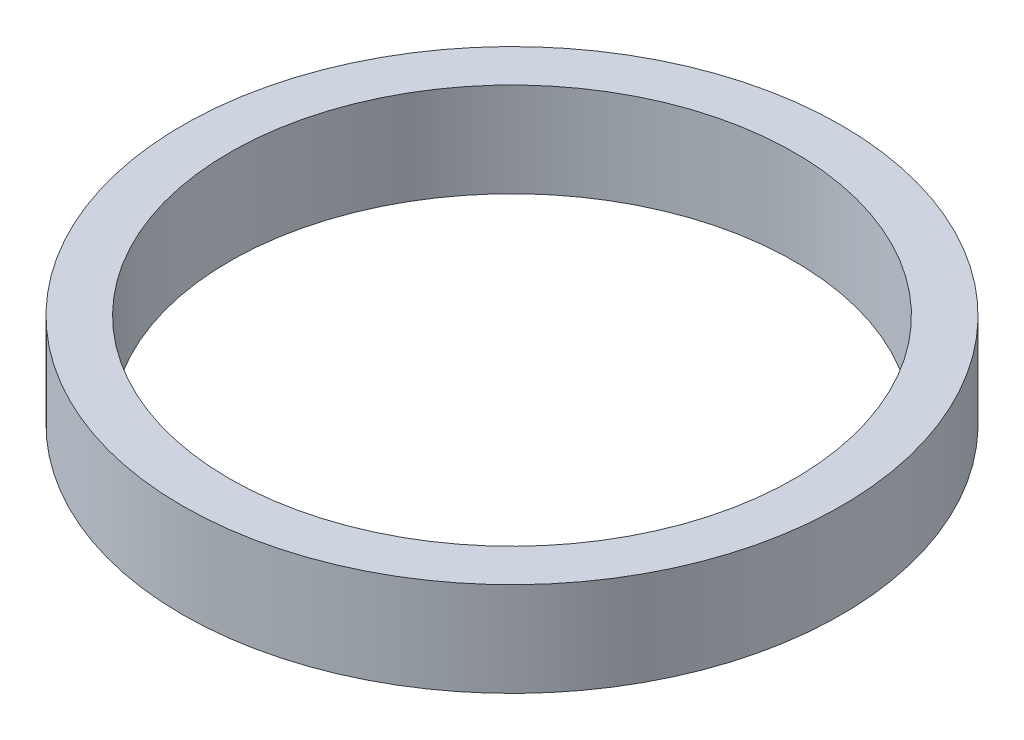
ISO-10303-21;
HEADER;
FILE_DESCRIPTION(('STEP AP214'),'2;1');
FILE_NAME('part.step','',(''),(''),'','','');
FILE_SCHEMA(('AUTOMOTIVE_DESIGN { 1 0 10303 214 1 1 1 1 }'));
ENDSEC;
DATA;
#1=APPLICATION_CONTEXT('core data for automotive mechanical design processes');
#2=APPLICATION_PROTOCOL_DEFINITION('international standard','automotive_design',2000,#1);
#3=PRODUCT_CONTEXT('',#1,'mechanical');
#4=PRODUCT('Part','Part','',(#3));
#5=PRODUCT_RELATED_PRODUCT_CATEGORY('part','',(#4));
#6=PRODUCT_DEFINITION_FORMATION('','',#4);
#7=PRODUCT_DEFINITION_CONTEXT('part definition',#1,'design');
#8=PRODUCT_DEFINITION('design','',#6,#7);
#9=PRODUCT_DEFINITION_SHAPE('','',#8);
#10=(LENGTH_UNIT() NAMED_UNIT(*) SI_UNIT(.MILLI.,.METRE.));
#11=(NAMED_UNIT(*) PLANE_ANGLE_UNIT() SI_UNIT($,.RADIAN.));
#12=(NAMED_UNIT(*) SI_UNIT($,.STERADIAN.) SOLID_ANGLE_UNIT());
#13=UNCERTAINTY_MEASURE_WITH_UNIT(LENGTH_MEASURE(1.E-05),#10,'distance_accuracy_value','');
#14=(GEOMETRIC_REPRESENTATION_CONTEXT(3) GLOBAL_UNCERTAINTY_ASSIGNED_CONTEXT((#13)) GLOBAL_UNIT_ASSIGNED_CONTEXT((#10,
#11,#12)) REPRESENTATION_CONTEXT('',''));
#15=CARTESIAN_POINT('',(0.,0.,0.));
#16=DIRECTION('',(0.,0.,1.));
#17=DIRECTION('',(1.,0.,0.));
#18=AXIS2_PLACEMENT_3D('',#15,#16,#17);
#19=CARTESIAN_POINT('',(0.,0.999999999999998,0.));
#20=DIRECTION('',(0.,1.,0.));
#21=DIRECTION('',(0.,0.,1.));
#22=AXIS2_PLACEMENT_3D('',#19,#20,#21);
#23=CYLINDRICAL_SURFACE('',#22,6.);
#24=CARTESIAN_POINT('',(0.,0.,0.));
#25=DIRECTION('',(0.,1.,0.));
#26=DIRECTION('',(0.,0.,1.));
#27=AXIS2_PLACEMENT_3D('',#24,#25,#26);
#28=CIRCLE('',#27,6.);
#29=CARTESIAN_POINT('',(0.,0.,6.));
#30=VERTEX_POINT('',#29);
#31=EDGE_CURVE('E18',#30,#30,#28,.T.);
#32=ORIENTED_EDGE('',*,*,#31,.F.);
#33=EDGE_LOOP('',(#32));
#34=FACE_BOUND('',#33,.T.);
#35=CARTESIAN_POINT('',(0.,2.,0.));
#36=DIRECTION('',(0.,1.,0.));
#37=DIRECTION('',(0.,0.,1.));
#38=AXIS2_PLACEMENT_3D('',#35,#36,#37);
#39=CIRCLE('',#38,6.);
#40=CARTESIAN_POINT('',(0.,2.,6.));
#41=VERTEX_POINT('',#40);
#42=EDGE_CURVE('E27',#41,#41,#39,.F.);
#43=ORIENTED_EDGE('',*,*,#42,.F.);
#44=EDGE_LOOP('',(#43));
#45=FACE_BOUND('',#44,.T.);
#46=ADVANCED_FACE('F15',(#34,#45),#23,.F.);
#47=CARTESIAN_POINT('',(-7.,0.,0.));
#48=DIRECTION('',(0.,-1.,0.));
#49=DIRECTION('',(0.,0.,-1.));
#50=AXIS2_PLACEMENT_3D('',#47,#48,#49);
#51=PLANE('',#50);
#52=CARTESIAN_POINT('',(0.,0.,0.));
#53=DIRECTION('',(0.,1.,0.));
#54=DIRECTION('',(0.,0.,1.));
#55=AXIS2_PLACEMENT_3D('',#52,#53,#54);
#56=CIRCLE('',#55,7.);
#57=CARTESIAN_POINT('',(0.,0.,7.));
#58=VERTEX_POINT('',#57);
#59=EDGE_CURVE('E22',#58,#58,#56,.T.);
#60=ORIENTED_EDGE('',*,*,#59,.F.);
#61=EDGE_LOOP('',(#60));
#62=FACE_BOUND('',#61,.T.);
#63=ORIENTED_EDGE('',*,*,#31,.T.);
#64=EDGE_LOOP('',(#63));
#65=FACE_BOUND('',#64,.T.);
#66=ADVANCED_FACE('F35',(#62,#65),#51,.T.);
#67=CARTESIAN_POINT('',(-6.,2.,0.));
#68=DIRECTION('',(0.,1.,0.));
#69=DIRECTION('',(0.,0.,1.));
#70=AXIS2_PLACEMENT_3D('',#67,#68,#69);
#71=PLANE('',#70);
#72=CARTESIAN_POINT('',(0.,2.,0.));
#73=DIRECTION('',(0.,1.,0.));
#74=DIRECTION('',(0.,0.,1.));
#75=AXIS2_PLACEMENT_3D('',#72,#73,#74);
#76=CIRCLE('',#75,7.);
#77=CARTESIAN_POINT('',(0.,2.,7.));
#78=VERTEX_POINT('',#77);
#79=EDGE_CURVE('E10',#78,#78,#76,.F.);
#80=ORIENTED_EDGE('',*,*,#79,.F.);
#81=EDGE_LOOP('',(#80));
#82=FACE_BOUND('',#81,.T.);
#83=ORIENTED_EDGE('',*,*,#42,.T.);
#84=EDGE_LOOP('',(#83));
#85=FACE_BOUND('',#84,.T.);
#86=ADVANCED_FACE('F43',(#82,#85),#71,.T.);
#87=CARTESIAN_POINT('',(0.,0.999999999999998,0.));
#88=DIRECTION('',(0.,1.,0.));
#89=DIRECTION('',(0.,0.,1.));
#90=AXIS2_PLACEMENT_3D('',#87,#88,#89);
#91=CYLINDRICAL_SURFACE('',#90,7.);
#92=ORIENTED_EDGE('',*,*,#79,.T.);
#93=EDGE_LOOP('',(#92));
#94=FACE_BOUND('',#93,.T.);
#95=ORIENTED_EDGE('',*,*,#59,.T.);
#96=EDGE_LOOP('',(#95));
#97=FACE_BOUND('',#96,.T.);
#98=ADVANCED_FACE('F45',(#94,#97),#91,.T.);
#99=CLOSED_SHELL('',(#46,#66,#86,#98));
#100=MANIFOLD_SOLID_BREP('B1',#99);
#101=ADVANCED_BREP_SHAPE_REPRESENTATION('',(#18,#100),#14);
#102=SHAPE_DEFINITION_REPRESENTATION(#9,#101);
ENDSEC;
END-ISO-10303-21;
